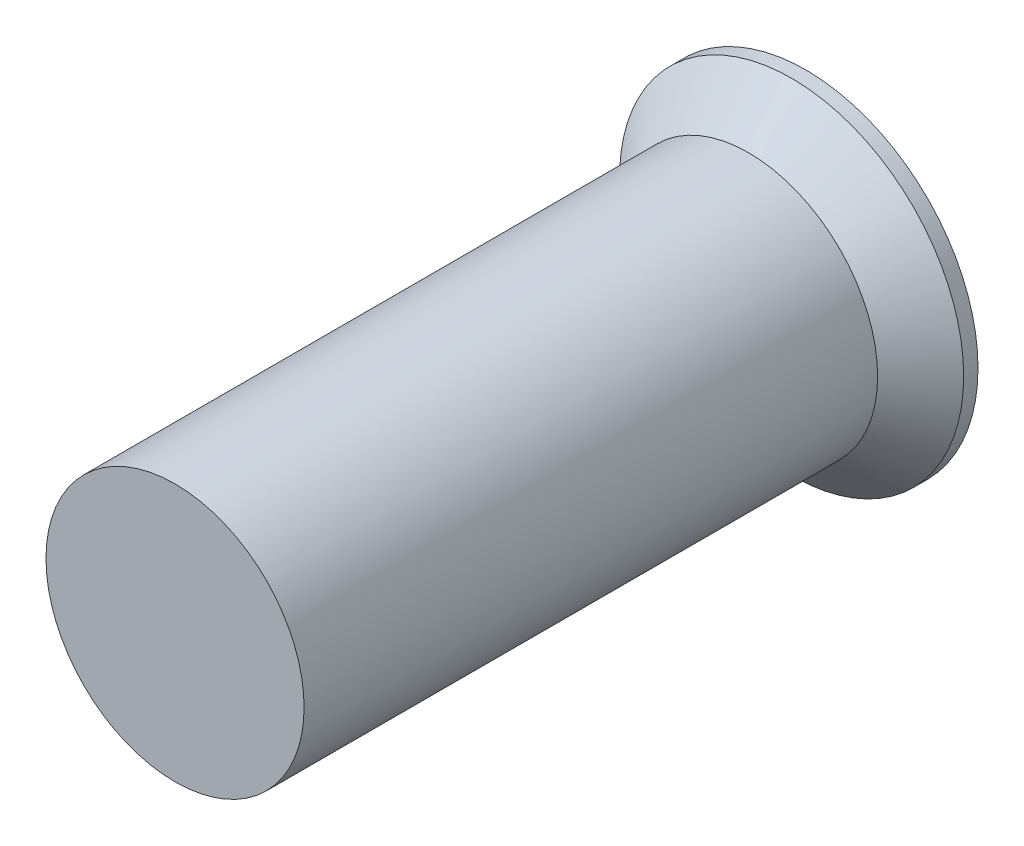
ISO-10303-21;
HEADER;
FILE_DESCRIPTION(('STEP AP214'),'2;1');
FILE_NAME('part.step','',(''),(''),'','','');
FILE_SCHEMA(('AUTOMOTIVE_DESIGN { 1 0 10303 214 1 1 1 1 }'));
ENDSEC;
DATA;
#1=APPLICATION_CONTEXT('core data for automotive mechanical design processes');
#2=APPLICATION_PROTOCOL_DEFINITION('international standard','automotive_design',2000,#1);
#3=PRODUCT_CONTEXT('',#1,'mechanical');
#4=PRODUCT('Part','Part','',(#3));
#5=PRODUCT_RELATED_PRODUCT_CATEGORY('part','',(#4));
#6=PRODUCT_DEFINITION_FORMATION('','',#4);
#7=PRODUCT_DEFINITION_CONTEXT('part definition',#1,'design');
#8=PRODUCT_DEFINITION('design','',#6,#7);
#9=PRODUCT_DEFINITION_SHAPE('','',#8);
#10=(LENGTH_UNIT() NAMED_UNIT(*) SI_UNIT(.MILLI.,.METRE.));
#11=(NAMED_UNIT(*) PLANE_ANGLE_UNIT() SI_UNIT($,.RADIAN.));
#12=(NAMED_UNIT(*) SI_UNIT($,.STERADIAN.) SOLID_ANGLE_UNIT());
#13=UNCERTAINTY_MEASURE_WITH_UNIT(LENGTH_MEASURE(1.E-05),#10,'distance_accuracy_value','');
#14=(GEOMETRIC_REPRESENTATION_CONTEXT(3) GLOBAL_UNCERTAINTY_ASSIGNED_CONTEXT((#13)) GLOBAL_UNIT_ASSIGNED_CONTEXT((#10,
#11,#12)) REPRESENTATION_CONTEXT('',''));
#15=CARTESIAN_POINT('',(0.,0.,0.));
#16=DIRECTION('',(0.,0.,1.));
#17=DIRECTION('',(1.,0.,0.));
#18=AXIS2_PLACEMENT_3D('',#15,#16,#17);
#19=CARTESIAN_POINT('',(0.,0.,1.));
#20=DIRECTION('',(0.,0.,-1.));
#21=DIRECTION('',(-1.,0.,0.));
#22=AXIS2_PLACEMENT_3D('',#19,#20,#21);
#23=CYLINDRICAL_SURFACE('',#22,3.);
#24=CARTESIAN_POINT('',(0.,0.,0.249999999999999));
#25=DIRECTION('',(0.,0.,1.));
#26=DIRECTION('',(1.,0.,0.));
#27=AXIS2_PLACEMENT_3D('',#24,#25,#26);
#28=CIRCLE('',#27,3.);
#29=CARTESIAN_POINT('',(3.,0.,0.249999999999999));
#30=VERTEX_POINT('',#29);
#31=EDGE_CURVE('E10',#30,#30,#28,.F.);
#32=ORIENTED_EDGE('',*,*,#31,.T.);
#33=EDGE_LOOP('',(#32));
#34=FACE_BOUND('',#33,.T.);
#35=CARTESIAN_POINT('',(0.,0.,0.));
#36=DIRECTION('',(0.,0.,1.));
#37=DIRECTION('',(1.,0.,0.));
#38=AXIS2_PLACEMENT_3D('',#35,#36,#37);
#39=CIRCLE('',#38,3.);
#40=CARTESIAN_POINT('',(3.,0.,0.));
#41=VERTEX_POINT('',#40);
#42=EDGE_CURVE('E49',#41,#41,#39,.T.);
#43=ORIENTED_EDGE('',*,*,#42,.T.);
#44=EDGE_LOOP('',(#43));
#45=FACE_BOUND('',#44,.T.);
#46=ADVANCED_FACE('F37',(#34,#45),#23,.T.);
#47=CARTESIAN_POINT('',(0.,0.,0.));
#48=DIRECTION('',(0.,0.,1.));
#49=DIRECTION('',(1.,0.,0.));
#50=AXIS2_PLACEMENT_3D('',#47,#48,#49);
#51=PLANE('',#50);
#52=ORIENTED_EDGE('',*,*,#42,.F.);
#53=EDGE_LOOP('',(#52));
#54=FACE_BOUND('',#53,.T.);
#55=ADVANCED_FACE('F69',(#54),#51,.F.);
#56=CARTESIAN_POINT('',(0.,0.,1.));
#57=DIRECTION('',(0.,0.,-1.));
#58=DIRECTION('',(-1.,0.,0.));
#59=AXIS2_PLACEMENT_3D('',#56,#57,#58);
#60=CONICAL_SURFACE('',#59,2.25,0.785398163397447);
#61=ORIENTED_EDGE('',*,*,#31,.F.);
#62=EDGE_LOOP('',(#61));
#63=FACE_BOUND('',#62,.T.);
#64=CARTESIAN_POINT('',(0.,0.,1.));
#65=DIRECTION('',(0.,0.,1.));
#66=DIRECTION('',(1.,0.,0.));
#67=AXIS2_PLACEMENT_3D('',#64,#65,#66);
#68=CIRCLE('',#67,2.25);
#69=CARTESIAN_POINT('',(2.25,0.,1.));
#70=VERTEX_POINT('',#69);
#71=EDGE_CURVE('E45',#70,#70,#68,.T.);
#72=ORIENTED_EDGE('',*,*,#71,.F.);
#73=EDGE_LOOP('',(#72));
#74=FACE_BOUND('',#73,.T.);
#75=ADVANCED_FACE('F40',(#63,#74),#60,.T.);
#76=CARTESIAN_POINT('',(0.,0.,11.));
#77=DIRECTION('',(0.,0.,-1.));
#78=DIRECTION('',(-1.,0.,0.));
#79=AXIS2_PLACEMENT_3D('',#76,#77,#78);
#80=CYLINDRICAL_SURFACE('',#79,2.25);
#81=CARTESIAN_POINT('',(0.,0.,11.));
#82=DIRECTION('',(0.,0.,1.));
#83=DIRECTION('',(1.,0.,0.));
#84=AXIS2_PLACEMENT_3D('',#81,#82,#83);
#85=CIRCLE('',#84,2.25);
#86=CARTESIAN_POINT('',(2.25,0.,11.));
#87=VERTEX_POINT('',#86);
#88=EDGE_CURVE('E53',#87,#87,#85,.T.);
#89=ORIENTED_EDGE('',*,*,#88,.F.);
#90=EDGE_LOOP('',(#89));
#91=FACE_BOUND('',#90,.T.);
#92=ORIENTED_EDGE('',*,*,#71,.T.);
#93=EDGE_LOOP('',(#92));
#94=FACE_BOUND('',#93,.T.);
#95=ADVANCED_FACE('F61',(#91,#94),#80,.T.);
#96=CARTESIAN_POINT('',(0.,0.,11.));
#97=DIRECTION('',(0.,0.,1.));
#98=DIRECTION('',(1.,0.,0.));
#99=AXIS2_PLACEMENT_3D('',#96,#97,#98);
#100=PLANE('',#99);
#101=ORIENTED_EDGE('',*,*,#88,.T.);
#102=EDGE_LOOP('',(#101));
#103=FACE_BOUND('',#102,.T.);
#104=ADVANCED_FACE('F59',(#103),#100,.T.);
#105=CLOSED_SHELL('',(#46,#55,#75,#95,#104));
#106=MANIFOLD_SOLID_BREP('B2',#105);
#107=ADVANCED_BREP_SHAPE_REPRESENTATION('',(#18,#106),#14);
#108=SHAPE_DEFINITION_REPRESENTATION(#9,#107);
ENDSEC;
END-ISO-10303-21;
